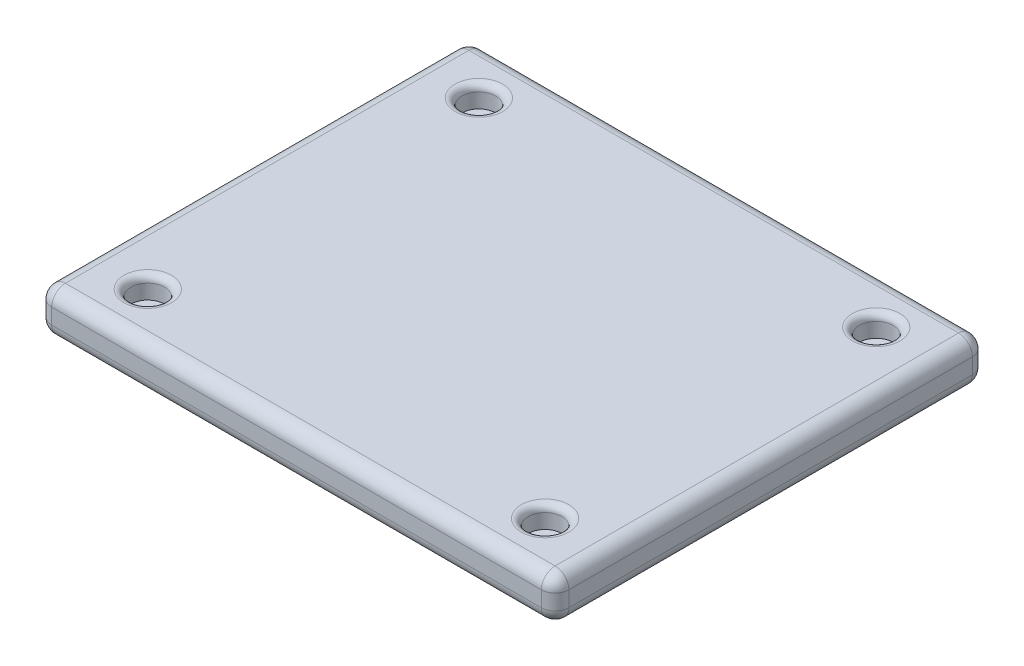
ISO-10303-21;
HEADER;
FILE_DESCRIPTION(('STEP AP214'),'2;1');
FILE_NAME('part.step','',(''),(''),'','','');
FILE_SCHEMA(('AUTOMOTIVE_DESIGN { 1 0 10303 214 1 1 1 1 }'));
ENDSEC;
DATA;
#1=APPLICATION_CONTEXT('core data for automotive mechanical design processes');
#2=APPLICATION_PROTOCOL_DEFINITION('international standard','automotive_design',2000,#1);
#3=PRODUCT_CONTEXT('',#1,'mechanical');
#4=PRODUCT('Part','Part','',(#3));
#5=PRODUCT_RELATED_PRODUCT_CATEGORY('part','',(#4));
#6=PRODUCT_DEFINITION_FORMATION('','',#4);
#7=PRODUCT_DEFINITION_CONTEXT('part definition',#1,'design');
#8=PRODUCT_DEFINITION('design','',#6,#7);
#9=PRODUCT_DEFINITION_SHAPE('','',#8);
#10=(LENGTH_UNIT() NAMED_UNIT(*) SI_UNIT(.MILLI.,.METRE.));
#11=(NAMED_UNIT(*) PLANE_ANGLE_UNIT() SI_UNIT($,.RADIAN.));
#12=(NAMED_UNIT(*) SI_UNIT($,.STERADIAN.) SOLID_ANGLE_UNIT());
#13=UNCERTAINTY_MEASURE_WITH_UNIT(LENGTH_MEASURE(1.E-05),#10,'distance_accuracy_value','');
#14=(GEOMETRIC_REPRESENTATION_CONTEXT(3) GLOBAL_UNCERTAINTY_ASSIGNED_CONTEXT((#13)) GLOBAL_UNIT_ASSIGNED_CONTEXT((#10,
#11,#12)) REPRESENTATION_CONTEXT('',''));
#15=CARTESIAN_POINT('',(0.,0.,0.));
#16=DIRECTION('',(0.,0.,1.));
#17=DIRECTION('',(1.,0.,0.));
#18=AXIS2_PLACEMENT_3D('',#15,#16,#17);
#19=CARTESIAN_POINT('',(-37.5000000000001,28.0362849678757,-31.25));
#20=DIRECTION('',(1.,0.,0.));
#21=DIRECTION('',(0.,0.,-1.));
#22=AXIS2_PLACEMENT_3D('',#19,#20,#21);
#23=PLANE('',#22);
#24=DIRECTION('',(0.,0.,1.));
#25=VECTOR('',#24,1.);
#26=CARTESIAN_POINT('',(-37.5000000000001,23.7862849678757,31.25));
#27=LINE('',#26,#25);
#28=CARTESIAN_POINT('',(-37.5000000000001,23.7862849678757,-29.25));
#29=VERTEX_POINT('',#28);
#30=CARTESIAN_POINT('',(-37.5000000000001,23.7862849678757,29.25));
#31=VERTEX_POINT('',#30);
#32=EDGE_CURVE('E173',#29,#31,#27,.T.);
#33=ORIENTED_EDGE('',*,*,#32,.T.);
#34=DIRECTION('',(0.,-1.,0.));
#35=VECTOR('',#34,1.);
#36=CARTESIAN_POINT('',(-37.5000000000001,28.0362849678757,29.25));
#37=LINE('',#36,#35);
#38=CARTESIAN_POINT('',(-37.5000000000001,26.0362849678757,29.25));
#39=VERTEX_POINT('',#38);
#40=EDGE_CURVE('E178',#31,#39,#37,.F.);
#41=ORIENTED_EDGE('',*,*,#40,.T.);
#42=DIRECTION('',(0.,0.,1.));
#43=VECTOR('',#42,1.);
#44=CARTESIAN_POINT('',(-37.5000000000001,26.0362849678757,-31.25));
#45=LINE('',#44,#43);
#46=CARTESIAN_POINT('',(-37.5000000000001,26.0362849678757,-29.25));
#47=VERTEX_POINT('',#46);
#48=EDGE_CURVE('E175',#39,#47,#45,.F.);
#49=ORIENTED_EDGE('',*,*,#48,.T.);
#50=DIRECTION('',(0.,-1.,0.));
#51=VECTOR('',#50,1.);
#52=CARTESIAN_POINT('',(-37.5000000000001,28.0362849678757,-29.25));
#53=LINE('',#52,#51);
#54=EDGE_CURVE('E171',#47,#29,#53,.T.);
#55=ORIENTED_EDGE('',*,*,#54,.T.);
#56=EDGE_LOOP('',(#33,#41,#49,#55));
#57=FACE_BOUND('',#56,.T.);
#58=ADVANCED_FACE('F37',(#57),#23,.F.);
#59=CARTESIAN_POINT('',(37.4999999999999,28.0362849678757,31.25));
#60=DIRECTION('',(0.,0.,-1.));
#61=DIRECTION('',(-1.,0.,0.));
#62=AXIS2_PLACEMENT_3D('',#59,#60,#61);
#63=PLANE('',#62);
#64=DIRECTION('',(1.,0.,0.));
#65=VECTOR('',#64,1.);
#66=CARTESIAN_POINT('',(37.4999999999999,26.0362849678757,31.25));
#67=LINE('',#66,#65);
#68=CARTESIAN_POINT('',(35.4999999999999,26.0362849678757,31.25));
#69=VERTEX_POINT('',#68);
#70=CARTESIAN_POINT('',(-35.5000000000001,26.0362849678757,31.25));
#71=VERTEX_POINT('',#70);
#72=EDGE_CURVE('E193',#69,#71,#67,.F.);
#73=ORIENTED_EDGE('',*,*,#72,.T.);
#74=DIRECTION('',(0.,-1.,0.));
#75=VECTOR('',#74,1.);
#76=CARTESIAN_POINT('',(-35.5000000000001,28.0362849678757,31.25));
#77=LINE('',#76,#75);
#78=CARTESIAN_POINT('',(-35.5000000000001,23.7862849678757,31.25));
#79=VERTEX_POINT('',#78);
#80=EDGE_CURVE('E195',#71,#79,#77,.T.);
#81=ORIENTED_EDGE('',*,*,#80,.T.);
#82=DIRECTION('',(1.,0.,0.));
#83=VECTOR('',#82,1.);
#84=CARTESIAN_POINT('',(37.4999999999999,23.7862849678757,31.25));
#85=LINE('',#84,#83);
#86=CARTESIAN_POINT('',(35.4999999999999,23.7862849678757,31.25));
#87=VERTEX_POINT('',#86);
#88=EDGE_CURVE('E191',#79,#87,#85,.T.);
#89=ORIENTED_EDGE('',*,*,#88,.T.);
#90=DIRECTION('',(0.,-1.,0.));
#91=VECTOR('',#90,1.);
#92=CARTESIAN_POINT('',(35.4999999999999,28.0362849678757,31.25));
#93=LINE('',#92,#91);
#94=EDGE_CURVE('E189',#87,#69,#93,.F.);
#95=ORIENTED_EDGE('',*,*,#94,.T.);
#96=EDGE_LOOP('',(#73,#81,#89,#95));
#97=FACE_BOUND('',#96,.T.);
#98=ADVANCED_FACE('F322',(#97),#63,.F.);
#99=CARTESIAN_POINT('',(37.4999999999999,28.0362849678757,-31.25));
#100=DIRECTION('',(-1.,0.,0.));
#101=DIRECTION('',(0.,0.,1.));
#102=AXIS2_PLACEMENT_3D('',#99,#100,#101);
#103=PLANE('',#102);
#104=DIRECTION('',(0.,0.,-1.));
#105=VECTOR('',#104,1.);
#106=CARTESIAN_POINT('',(37.4999999999999,26.0362849678757,-31.25));
#107=LINE('',#106,#105);
#108=CARTESIAN_POINT('',(37.4999999999999,26.0362849678757,-29.25));
#109=VERTEX_POINT('',#108);
#110=CARTESIAN_POINT('',(37.4999999999999,26.0362849678757,29.25));
#111=VERTEX_POINT('',#110);
#112=EDGE_CURVE('E143',#109,#111,#107,.F.);
#113=ORIENTED_EDGE('',*,*,#112,.T.);
#114=DIRECTION('',(0.,-1.,0.));
#115=VECTOR('',#114,1.);
#116=CARTESIAN_POINT('',(37.4999999999999,28.0362849678757,29.25));
#117=LINE('',#116,#115);
#118=CARTESIAN_POINT('',(37.4999999999999,23.7862849678757,29.25));
#119=VERTEX_POINT('',#118);
#120=EDGE_CURVE('E203',#111,#119,#117,.T.);
#121=ORIENTED_EDGE('',*,*,#120,.T.);
#122=DIRECTION('',(0.,0.,-1.));
#123=VECTOR('',#122,1.);
#124=CARTESIAN_POINT('',(37.4999999999999,23.7862849678757,-31.25));
#125=LINE('',#124,#123);
#126=CARTESIAN_POINT('',(37.4999999999999,23.7862849678757,-29.25));
#127=VERTEX_POINT('',#126);
#128=EDGE_CURVE('E200',#119,#127,#125,.T.);
#129=ORIENTED_EDGE('',*,*,#128,.T.);
#130=DIRECTION('',(0.,-1.,0.));
#131=VECTOR('',#130,1.);
#132=CARTESIAN_POINT('',(37.4999999999999,28.0362849678757,-29.25));
#133=LINE('',#132,#131);
#134=EDGE_CURVE('E198',#127,#109,#133,.F.);
#135=ORIENTED_EDGE('',*,*,#134,.T.);
#136=EDGE_LOOP('',(#113,#121,#129,#135));
#137=FACE_BOUND('',#136,.T.);
#138=ADVANCED_FACE('F328',(#137),#103,.F.);
#139=CARTESIAN_POINT('',(37.4999999999999,28.0362849678757,-31.25));
#140=DIRECTION('',(0.,0.,1.));
#141=DIRECTION('',(1.,0.,0.));
#142=AXIS2_PLACEMENT_3D('',#139,#140,#141);
#143=PLANE('',#142);
#144=DIRECTION('',(-1.,0.,0.));
#145=VECTOR('',#144,1.);
#146=CARTESIAN_POINT('',(37.4999999999999,26.0362849678757,-31.25));
#147=LINE('',#146,#145);
#148=CARTESIAN_POINT('',(-35.5000000000001,26.0362849678757,-31.25));
#149=VERTEX_POINT('',#148);
#150=CARTESIAN_POINT('',(35.4999999999999,26.0362849678757,-31.25));
#151=VERTEX_POINT('',#150);
#152=EDGE_CURVE('E46',#149,#151,#147,.F.);
#153=ORIENTED_EDGE('',*,*,#152,.T.);
#154=DIRECTION('',(0.,-1.,0.));
#155=VECTOR('',#154,1.);
#156=CARTESIAN_POINT('',(35.4999999999999,28.0362849678757,-31.25));
#157=LINE('',#156,#155);
#158=CARTESIAN_POINT('',(35.4999999999999,23.7862849678757,-31.25));
#159=VERTEX_POINT('',#158);
#160=EDGE_CURVE('E11',#151,#159,#157,.T.);
#161=ORIENTED_EDGE('',*,*,#160,.T.);
#162=DIRECTION('',(-1.,0.,0.));
#163=VECTOR('',#162,1.);
#164=CARTESIAN_POINT('',(-37.5000000000001,23.7862849678757,-31.25));
#165=LINE('',#164,#163);
#166=CARTESIAN_POINT('',(-35.5000000000001,23.7862849678757,-31.25));
#167=VERTEX_POINT('',#166);
#168=EDGE_CURVE('E206',#159,#167,#165,.T.);
#169=ORIENTED_EDGE('',*,*,#168,.T.);
#170=DIRECTION('',(0.,-1.,0.));
#171=VECTOR('',#170,1.);
#172=CARTESIAN_POINT('',(-35.5000000000001,28.0362849678757,-31.25));
#173=LINE('',#172,#171);
#174=EDGE_CURVE('E57',#167,#149,#173,.F.);
#175=ORIENTED_EDGE('',*,*,#174,.T.);
#176=EDGE_LOOP('',(#153,#161,#169,#175));
#177=FACE_BOUND('',#176,.T.);
#178=ADVANCED_FACE('F364',(#177),#143,.F.);
#179=CARTESIAN_POINT('',(0.,28.0362849678757,0.));
#180=DIRECTION('',(0.,-1.,0.));
#181=DIRECTION('',(0.,0.,-1.));
#182=AXIS2_PLACEMENT_3D('',#179,#180,#181);
#183=PLANE('',#182);
#184=DIRECTION('',(-1.,0.,0.));
#185=VECTOR('',#184,1.);
#186=CARTESIAN_POINT('',(-1.01765154403783E-13,28.0362849678757,-29.25));
#187=LINE('',#186,#185);
#188=CARTESIAN_POINT('',(35.4999999999999,28.0362849678757,-29.25));
#189=VERTEX_POINT('',#188);
#190=CARTESIAN_POINT('',(-35.5000000000001,28.0362849678757,-29.25));
#191=VERTEX_POINT('',#190);
#192=EDGE_CURVE('E130',#189,#191,#187,.T.);
#193=ORIENTED_EDGE('',*,*,#192,.T.);
#194=DIRECTION('',(0.,0.,1.));
#195=VECTOR('',#194,1.);
#196=CARTESIAN_POINT('',(-35.5000000000001,28.0362849678757,0.));
#197=LINE('',#196,#195);
#198=CARTESIAN_POINT('',(-35.5000000000001,28.0362849678757,29.25));
#199=VERTEX_POINT('',#198);
#200=EDGE_CURVE('E169',#191,#199,#197,.T.);
#201=ORIENTED_EDGE('',*,*,#200,.T.);
#202=DIRECTION('',(1.,0.,0.));
#203=VECTOR('',#202,1.);
#204=CARTESIAN_POINT('',(0.,28.0362849678757,29.25));
#205=LINE('',#204,#203);
#206=CARTESIAN_POINT('',(35.4999999999999,28.0362849678757,29.25));
#207=VERTEX_POINT('',#206);
#208=EDGE_CURVE('E133',#199,#207,#205,.T.);
#209=ORIENTED_EDGE('',*,*,#208,.T.);
#210=DIRECTION('',(0.,0.,-1.));
#211=VECTOR('',#210,1.);
#212=CARTESIAN_POINT('',(35.4999999999999,28.0362849678757,0.));
#213=LINE('',#212,#211);
#214=EDGE_CURVE('E124',#207,#189,#213,.T.);
#215=ORIENTED_EDGE('',*,*,#214,.T.);
#216=EDGE_LOOP('',(#193,#201,#209,#215));
#217=FACE_BOUND('',#216,.T.);
#218=CARTESIAN_POINT('',(-28.8082979849017,28.0362849678757,24.006914987418));
#219=DIRECTION('',(0.,-1.,0.));
#220=DIRECTION('',(0.,0.,-1.));
#221=AXIS2_PLACEMENT_3D('',#218,#219,#220);
#222=CIRCLE('',#221,3.45);
#223=CARTESIAN_POINT('',(-28.8082979849017,28.0362849678757,20.556914987418));
#224=VERTEX_POINT('',#223);
#225=EDGE_CURVE('E294',#224,#224,#222,.T.);
#226=ORIENTED_EDGE('',*,*,#225,.T.);
#227=EDGE_LOOP('',(#226));
#228=FACE_BOUND('',#227,.T.);
#229=CARTESIAN_POINT('',(28.8082979849017,28.0362849678757,24.0069149874178));
#230=DIRECTION('',(0.,-1.,0.));
#231=DIRECTION('',(0.,0.,-1.));
#232=AXIS2_PLACEMENT_3D('',#229,#230,#231);
#233=CIRCLE('',#232,3.45);
#234=CARTESIAN_POINT('',(28.8082979849017,28.0362849678757,20.5569149874178));
#235=VERTEX_POINT('',#234);
#236=EDGE_CURVE('E291',#235,#235,#233,.T.);
#237=ORIENTED_EDGE('',*,*,#236,.T.);
#238=EDGE_LOOP('',(#237));
#239=FACE_BOUND('',#238,.T.);
#240=CARTESIAN_POINT('',(28.8082979849017,28.0362849678757,-24.0069149874178));
#241=DIRECTION('',(0.,-1.,0.));
#242=DIRECTION('',(0.,0.,-1.));
#243=AXIS2_PLACEMENT_3D('',#240,#241,#242);
#244=CIRCLE('',#243,3.45);
#245=CARTESIAN_POINT('',(28.8082979849017,28.0362849678757,-27.4569149874178));
#246=VERTEX_POINT('',#245);
#247=EDGE_CURVE('E288',#246,#246,#244,.T.);
#248=ORIENTED_EDGE('',*,*,#247,.T.);
#249=EDGE_LOOP('',(#248));
#250=FACE_BOUND('',#249,.T.);
#251=CARTESIAN_POINT('',(-28.8082979849017,28.0362849678757,-24.006914987418));
#252=DIRECTION('',(0.,-1.,0.));
#253=DIRECTION('',(0.,0.,-1.));
#254=AXIS2_PLACEMENT_3D('',#251,#252,#253);
#255=CIRCLE('',#254,3.45);
#256=CARTESIAN_POINT('',(-28.8082979849017,28.0362849678757,-27.456914987418));
#257=VERTEX_POINT('',#256);
#258=EDGE_CURVE('E285',#257,#257,#255,.T.);
#259=ORIENTED_EDGE('',*,*,#258,.T.);
#260=EDGE_LOOP('',(#259));
#261=FACE_BOUND('',#260,.T.);
#262=ADVANCED_FACE('F126',(#217,#228,#239,#250,#261),#183,.F.);
#263=CARTESIAN_POINT('',(0.,21.7862849678757,0.));
#264=DIRECTION('',(0.,-1.,0.));
#265=DIRECTION('',(0.,0.,-1.));
#266=AXIS2_PLACEMENT_3D('',#263,#264,#265);
#267=PLANE('',#266);
#268=DIRECTION('',(1.,0.,0.));
#269=VECTOR('',#268,1.);
#270=CARTESIAN_POINT('',(-37.5000000000001,21.7862849678757,29.25));
#271=LINE('',#270,#269);
#272=CARTESIAN_POINT('',(35.4999999999999,21.7862849678757,29.25));
#273=VERTEX_POINT('',#272);
#274=CARTESIAN_POINT('',(-35.5000000000001,21.7862849678757,29.25));
#275=VERTEX_POINT('',#274);
#276=EDGE_CURVE('E184',#273,#275,#271,.F.);
#277=ORIENTED_EDGE('',*,*,#276,.T.);
#278=DIRECTION('',(0.,0.,1.));
#279=VECTOR('',#278,1.);
#280=CARTESIAN_POINT('',(-35.5000000000001,21.7862849678757,-31.25));
#281=LINE('',#280,#279);
#282=CARTESIAN_POINT('',(-35.5000000000001,21.7862849678757,-29.25));
#283=VERTEX_POINT('',#282);
#284=EDGE_CURVE('E186',#275,#283,#281,.F.);
#285=ORIENTED_EDGE('',*,*,#284,.T.);
#286=DIRECTION('',(-1.,0.,0.));
#287=VECTOR('',#286,1.);
#288=CARTESIAN_POINT('',(37.4999999999999,21.7862849678757,-29.25));
#289=LINE('',#288,#287);
#290=CARTESIAN_POINT('',(35.4999999999999,21.7862849678757,-29.25));
#291=VERTEX_POINT('',#290);
#292=EDGE_CURVE('E180',#283,#291,#289,.F.);
#293=ORIENTED_EDGE('',*,*,#292,.T.);
#294=DIRECTION('',(0.,0.,-1.));
#295=VECTOR('',#294,1.);
#296=CARTESIAN_POINT('',(35.4999999999999,21.7862849678757,31.25));
#297=LINE('',#296,#295);
#298=EDGE_CURVE('E182',#291,#273,#297,.F.);
#299=ORIENTED_EDGE('',*,*,#298,.T.);
#300=EDGE_LOOP('',(#277,#285,#293,#299));
#301=FACE_BOUND('',#300,.T.);
#302=ADVANCED_FACE('F349',(#301),#267,.T.);
#303=CARTESIAN_POINT('',(-28.8082979849017,24.9112849678757,24.006914987418));
#304=DIRECTION('',(0.,1.,0.));
#305=DIRECTION('',(0.,0.,1.));
#306=AXIS2_PLACEMENT_3D('',#303,#304,#305);
#307=CYLINDRICAL_SURFACE('',#306,2.45);
#308=CARTESIAN_POINT('',(-28.8082979849017,27.0362849678757,24.006914987418));
#309=DIRECTION('',(0.,-1.,0.));
#310=DIRECTION('',(0.,0.,-1.));
#311=AXIS2_PLACEMENT_3D('',#308,#309,#310);
#312=CIRCLE('',#311,2.45);
#313=CARTESIAN_POINT('',(-28.8082979849017,27.0362849678757,21.556914987418));
#314=VERTEX_POINT('',#313);
#315=EDGE_CURVE('E282',#314,#314,#312,.F.);
#316=ORIENTED_EDGE('',*,*,#315,.T.);
#317=EDGE_LOOP('',(#316));
#318=FACE_BOUND('',#317,.T.);
#319=CARTESIAN_POINT('',(-28.8082979849017,24.9112849678757,24.006914987418));
#320=DIRECTION('',(0.,1.,0.));
#321=DIRECTION('',(0.,0.,1.));
#322=AXIS2_PLACEMENT_3D('',#319,#320,#321);
#323=CIRCLE('',#322,2.45);
#324=CARTESIAN_POINT('',(-28.8082979849017,24.9112849678757,26.456914987418));
#325=VERTEX_POINT('',#324);
#326=EDGE_CURVE('E279',#325,#325,#323,.T.);
#327=ORIENTED_EDGE('',*,*,#326,.F.);
#328=EDGE_LOOP('',(#327));
#329=FACE_BOUND('',#328,.T.);
#330=ADVANCED_FACE('F345',(#318,#329),#307,.F.);
#331=CARTESIAN_POINT('',(-28.8082979849017,24.9112849678757,24.006914987418));
#332=DIRECTION('',(0.,1.,0.));
#333=DIRECTION('',(0.,0.,1.));
#334=AXIS2_PLACEMENT_3D('',#331,#332,#333);
#335=PLANE('',#334);
#336=ORIENTED_EDGE('',*,*,#326,.T.);
#337=EDGE_LOOP('',(#336));
#338=FACE_BOUND('',#337,.T.);
#339=ADVANCED_FACE('F348',(#338),#335,.T.);
#340=CARTESIAN_POINT('',(28.8082979849017,24.9112849678757,-24.0069149874178));
#341=DIRECTION('',(0.,1.,0.));
#342=DIRECTION('',(0.,0.,1.));
#343=AXIS2_PLACEMENT_3D('',#340,#341,#342);
#344=CYLINDRICAL_SURFACE('',#343,2.45);
#345=CARTESIAN_POINT('',(28.8082979849017,27.0362849678757,-24.0069149874178));
#346=DIRECTION('',(0.,-1.,0.));
#347=DIRECTION('',(0.,0.,-1.));
#348=AXIS2_PLACEMENT_3D('',#345,#346,#347);
#349=CIRCLE('',#348,2.45);
#350=CARTESIAN_POINT('',(28.8082979849017,27.0362849678757,-26.4569149874178));
#351=VERTEX_POINT('',#350);
#352=EDGE_CURVE('E164',#351,#351,#349,.F.);
#353=ORIENTED_EDGE('',*,*,#352,.T.);
#354=EDGE_LOOP('',(#353));
#355=FACE_BOUND('',#354,.T.);
#356=CARTESIAN_POINT('',(28.8082979849017,24.9112849678757,-24.0069149874178));
#357=DIRECTION('',(0.,1.,0.));
#358=DIRECTION('',(0.,0.,1.));
#359=AXIS2_PLACEMENT_3D('',#356,#357,#358);
#360=CIRCLE('',#359,2.45);
#361=CARTESIAN_POINT('',(28.8082979849017,24.9112849678757,-21.5569149874178));
#362=VERTEX_POINT('',#361);
#363=EDGE_CURVE('E275',#362,#362,#360,.T.);
#364=ORIENTED_EDGE('',*,*,#363,.F.);
#365=EDGE_LOOP('',(#364));
#366=FACE_BOUND('',#365,.T.);
#367=ADVANCED_FACE('F302',(#355,#366),#344,.F.);
#368=CARTESIAN_POINT('',(28.8082979849017,24.9112849678757,-24.0069149874178));
#369=DIRECTION('',(0.,1.,0.));
#370=DIRECTION('',(0.,0.,1.));
#371=AXIS2_PLACEMENT_3D('',#368,#369,#370);
#372=PLANE('',#371);
#373=ORIENTED_EDGE('',*,*,#363,.T.);
#374=EDGE_LOOP('',(#373));
#375=FACE_BOUND('',#374,.T.);
#376=ADVANCED_FACE('F358',(#375),#372,.T.);
#377=CARTESIAN_POINT('',(28.8082979849017,24.9112849678757,24.0069149874178));
#378=DIRECTION('',(0.,1.,0.));
#379=DIRECTION('',(0.,0.,1.));
#380=AXIS2_PLACEMENT_3D('',#377,#378,#379);
#381=CYLINDRICAL_SURFACE('',#380,2.45);
#382=CARTESIAN_POINT('',(28.8082979849017,27.0362849678757,24.0069149874178));
#383=DIRECTION('',(0.,-1.,0.));
#384=DIRECTION('',(0.,0.,-1.));
#385=AXIS2_PLACEMENT_3D('',#382,#383,#384);
#386=CIRCLE('',#385,2.45);
#387=CARTESIAN_POINT('',(28.8082979849017,27.0362849678757,21.5569149874178));
#388=VERTEX_POINT('',#387);
#389=EDGE_CURVE('E297',#388,#388,#386,.F.);
#390=ORIENTED_EDGE('',*,*,#389,.T.);
#391=EDGE_LOOP('',(#390));
#392=FACE_BOUND('',#391,.T.);
#393=CARTESIAN_POINT('',(28.8082979849017,24.9112849678757,24.0069149874178));
#394=DIRECTION('',(0.,1.,0.));
#395=DIRECTION('',(0.,0.,-1.));
#396=AXIS2_PLACEMENT_3D('',#393,#394,#395);
#397=CIRCLE('',#396,2.45);
#398=CARTESIAN_POINT('',(28.8082979849017,24.9112849678757,21.5569149874178));
#399=VERTEX_POINT('',#398);
#400=EDGE_CURVE('E270',#399,#399,#397,.T.);
#401=ORIENTED_EDGE('',*,*,#400,.F.);
#402=EDGE_LOOP('',(#401));
#403=FACE_BOUND('',#402,.T.);
#404=ADVANCED_FACE('F630',(#392,#403),#381,.F.);
#405=CARTESIAN_POINT('',(28.8082979849017,24.9112849678757,24.0069149874178));
#406=DIRECTION('',(0.,-1.,0.));
#407=DIRECTION('',(0.,0.,-1.));
#408=AXIS2_PLACEMENT_3D('',#405,#406,#407);
#409=PLANE('',#408);
#410=ORIENTED_EDGE('',*,*,#400,.T.);
#411=EDGE_LOOP('',(#410));
#412=FACE_BOUND('',#411,.T.);
#413=ADVANCED_FACE('F622',(#412),#409,.F.);
#414=CARTESIAN_POINT('',(-28.8082979849017,24.9112849678757,-24.006914987418));
#415=DIRECTION('',(0.,1.,0.));
#416=DIRECTION('',(0.,0.,1.));
#417=AXIS2_PLACEMENT_3D('',#414,#415,#416);
#418=CYLINDRICAL_SURFACE('',#417,2.45);
#419=CARTESIAN_POINT('',(-28.8082979849017,27.0362849678757,-24.006914987418));
#420=DIRECTION('',(0.,-1.,0.));
#421=DIRECTION('',(0.,0.,-1.));
#422=AXIS2_PLACEMENT_3D('',#419,#420,#421);
#423=CIRCLE('',#422,2.45);
#424=CARTESIAN_POINT('',(-28.8082979849017,27.0362849678757,-26.456914987418));
#425=VERTEX_POINT('',#424);
#426=EDGE_CURVE('E161',#425,#425,#423,.F.);
#427=ORIENTED_EDGE('',*,*,#426,.T.);
#428=EDGE_LOOP('',(#427));
#429=FACE_BOUND('',#428,.T.);
#430=CARTESIAN_POINT('',(-28.8082979849017,24.9112849678757,-24.006914987418));
#431=DIRECTION('',(0.,1.,0.));
#432=DIRECTION('',(0.,0.,-1.));
#433=AXIS2_PLACEMENT_3D('',#430,#431,#432);
#434=CIRCLE('',#433,2.45);
#435=CARTESIAN_POINT('',(-28.8082979849017,24.9112849678757,-26.456914987418));
#436=VERTEX_POINT('',#435);
#437=EDGE_CURVE('E264',#436,#436,#434,.T.);
#438=ORIENTED_EDGE('',*,*,#437,.F.);
#439=EDGE_LOOP('',(#438));
#440=FACE_BOUND('',#439,.T.);
#441=ADVANCED_FACE('F339',(#429,#440),#418,.F.);
#442=CARTESIAN_POINT('',(-28.8082979849017,24.9112849678757,-24.006914987418));
#443=DIRECTION('',(0.,-1.,0.));
#444=DIRECTION('',(0.,0.,-1.));
#445=AXIS2_PLACEMENT_3D('',#442,#443,#444);
#446=PLANE('',#445);
#447=ORIENTED_EDGE('',*,*,#437,.T.);
#448=EDGE_LOOP('',(#447));
#449=FACE_BOUND('',#448,.T.);
#450=ADVANCED_FACE('F334',(#449),#446,.F.);
#451=CARTESIAN_POINT('',(-28.8082979849017,27.0362849678757,24.006914987418));
#452=DIRECTION('',(0.,-1.,0.));
#453=DIRECTION('',(0.,0.,-1.));
#454=AXIS2_PLACEMENT_3D('',#451,#452,#453);
#455=TOROIDAL_SURFACE('',#454,3.45,1.);
#456=ORIENTED_EDGE('',*,*,#225,.F.);
#457=EDGE_LOOP('',(#456));
#458=FACE_BOUND('',#457,.T.);
#459=ORIENTED_EDGE('',*,*,#315,.F.);
#460=EDGE_LOOP('',(#459));
#461=FACE_BOUND('',#460,.T.);
#462=ADVANCED_FACE('F317',(#458,#461),#455,.T.);
#463=CARTESIAN_POINT('',(28.8082979849017,27.0362849678757,24.0069149874178));
#464=DIRECTION('',(0.,-1.,0.));
#465=DIRECTION('',(0.,0.,-1.));
#466=AXIS2_PLACEMENT_3D('',#463,#464,#465);
#467=TOROIDAL_SURFACE('',#466,3.45,1.);
#468=ORIENTED_EDGE('',*,*,#236,.F.);
#469=EDGE_LOOP('',(#468));
#470=FACE_BOUND('',#469,.T.);
#471=ORIENTED_EDGE('',*,*,#389,.F.);
#472=EDGE_LOOP('',(#471));
#473=FACE_BOUND('',#472,.T.);
#474=ADVANCED_FACE('F308',(#470,#473),#467,.T.);
#475=CARTESIAN_POINT('',(28.8082979849017,27.0362849678757,-24.0069149874178));
#476=DIRECTION('',(0.,-1.,0.));
#477=DIRECTION('',(0.,0.,-1.));
#478=AXIS2_PLACEMENT_3D('',#475,#476,#477);
#479=TOROIDAL_SURFACE('',#478,3.45,1.);
#480=ORIENTED_EDGE('',*,*,#247,.F.);
#481=EDGE_LOOP('',(#480));
#482=FACE_BOUND('',#481,.T.);
#483=ORIENTED_EDGE('',*,*,#352,.F.);
#484=EDGE_LOOP('',(#483));
#485=FACE_BOUND('',#484,.T.);
#486=ADVANCED_FACE('F305',(#482,#485),#479,.T.);
#487=CARTESIAN_POINT('',(-28.8082979849017,27.0362849678757,-24.006914987418));
#488=DIRECTION('',(0.,-1.,0.));
#489=DIRECTION('',(0.,0.,-1.));
#490=AXIS2_PLACEMENT_3D('',#487,#488,#489);
#491=TOROIDAL_SURFACE('',#490,3.45,1.);
#492=ORIENTED_EDGE('',*,*,#258,.F.);
#493=EDGE_LOOP('',(#492));
#494=FACE_BOUND('',#493,.T.);
#495=ORIENTED_EDGE('',*,*,#426,.F.);
#496=EDGE_LOOP('',(#495));
#497=FACE_BOUND('',#496,.T.);
#498=ADVANCED_FACE('F307',(#494,#497),#491,.T.);
#499=CARTESIAN_POINT('',(35.4999999999999,23.7862849678757,-31.25));
#500=DIRECTION('',(0.,0.,1.));
#501=DIRECTION('',(1.,0.,0.));
#502=AXIS2_PLACEMENT_3D('',#499,#500,#501);
#503=CYLINDRICAL_SURFACE('',#502,2.);
#504=CARTESIAN_POINT('',(35.4999999999999,23.7862849678757,-29.25));
#505=DIRECTION('',(0.,0.,-1.));
#506=DIRECTION('',(-1.,0.,0.));
#507=AXIS2_PLACEMENT_3D('',#504,#505,#506);
#508=CIRCLE('',#507,2.);
#509=EDGE_CURVE('E41',#127,#291,#508,.T.);
#510=ORIENTED_EDGE('',*,*,#509,.F.);
#511=ORIENTED_EDGE('',*,*,#128,.F.);
#512=CARTESIAN_POINT('',(35.4999999999999,23.7862849678757,29.25));
#513=DIRECTION('',(0.,0.,1.));
#514=DIRECTION('',(1.,0.,0.));
#515=AXIS2_PLACEMENT_3D('',#512,#513,#514);
#516=CIRCLE('',#515,2.);
#517=EDGE_CURVE('E256',#273,#119,#516,.T.);
#518=ORIENTED_EDGE('',*,*,#517,.F.);
#519=ORIENTED_EDGE('',*,*,#298,.F.);
#520=EDGE_LOOP('',(#510,#511,#518,#519));
#521=FACE_BOUND('',#520,.T.);
#522=ADVANCED_FACE('F39',(#521),#503,.T.);
#523=CARTESIAN_POINT('',(35.4999999999999,23.7862849678757,-29.25));
#524=DIRECTION('',(0.,-1.,0.));
#525=DIRECTION('',(0.,0.,-1.));
#526=AXIS2_PLACEMENT_3D('',#523,#524,#525);
#527=SPHERICAL_SURFACE('',#526,2.);
#528=CARTESIAN_POINT('',(35.4999999999999,23.7862849678757,-29.25));
#529=DIRECTION('',(0.,-1.,0.));
#530=DIRECTION('',(0.,0.,-1.));
#531=AXIS2_PLACEMENT_3D('',#528,#529,#530);
#532=CIRCLE('',#531,2.);
#533=EDGE_CURVE('E251',#127,#159,#532,.F.);
#534=ORIENTED_EDGE('',*,*,#533,.F.);
#535=ORIENTED_EDGE('',*,*,#509,.T.);
#536=CARTESIAN_POINT('',(35.4999999999999,23.7862849678757,-29.25));
#537=DIRECTION('',(1.,0.,0.));
#538=DIRECTION('',(0.,0.,-1.));
#539=AXIS2_PLACEMENT_3D('',#536,#537,#538);
#540=CIRCLE('',#539,2.);
#541=EDGE_CURVE('E254',#159,#291,#540,.F.);
#542=ORIENTED_EDGE('',*,*,#541,.F.);
#543=EDGE_LOOP('',(#534,#535,#542));
#544=FACE_BOUND('',#543,.T.);
#545=ADVANCED_FACE('F404',(#544),#527,.T.);
#546=CARTESIAN_POINT('',(35.4999999999999,23.7862849678757,29.25));
#547=DIRECTION('',(1.,0.,0.));
#548=DIRECTION('',(0.,0.,-1.));
#549=AXIS2_PLACEMENT_3D('',#546,#547,#548);
#550=SPHERICAL_SURFACE('',#549,2.);
#551=CARTESIAN_POINT('',(35.4999999999999,23.7862849678757,29.25));
#552=DIRECTION('',(1.,0.,0.));
#553=DIRECTION('',(0.,0.,-1.));
#554=AXIS2_PLACEMENT_3D('',#551,#552,#553);
#555=CIRCLE('',#554,2.);
#556=EDGE_CURVE('E246',#273,#87,#555,.F.);
#557=ORIENTED_EDGE('',*,*,#556,.F.);
#558=ORIENTED_EDGE('',*,*,#517,.T.);
#559=CARTESIAN_POINT('',(35.4999999999999,23.7862849678757,29.25));
#560=DIRECTION('',(0.,-1.,0.));
#561=DIRECTION('',(0.,0.,-1.));
#562=AXIS2_PLACEMENT_3D('',#559,#560,#561);
#563=CIRCLE('',#562,2.);
#564=EDGE_CURVE('E249',#87,#119,#563,.F.);
#565=ORIENTED_EDGE('',*,*,#564,.F.);
#566=EDGE_LOOP('',(#557,#558,#565));
#567=FACE_BOUND('',#566,.T.);
#568=ADVANCED_FACE('F401',(#567),#550,.T.);
#569=CARTESIAN_POINT('',(37.4999999999999,23.7862849678757,-29.25));
#570=DIRECTION('',(1.,0.,0.));
#571=DIRECTION('',(0.,0.,-1.));
#572=AXIS2_PLACEMENT_3D('',#569,#570,#571);
#573=CYLINDRICAL_SURFACE('',#572,2.);
#574=ORIENTED_EDGE('',*,*,#541,.T.);
#575=ORIENTED_EDGE('',*,*,#292,.F.);
#576=CARTESIAN_POINT('',(-35.5000000000001,23.7862849678757,-29.25));
#577=DIRECTION('',(-1.,0.,0.));
#578=DIRECTION('',(0.,0.,1.));
#579=AXIS2_PLACEMENT_3D('',#576,#577,#578);
#580=CIRCLE('',#579,2.);
#581=EDGE_CURVE('E241',#167,#283,#580,.T.);
#582=ORIENTED_EDGE('',*,*,#581,.F.);
#583=ORIENTED_EDGE('',*,*,#168,.F.);
#584=EDGE_LOOP('',(#574,#575,#582,#583));
#585=FACE_BOUND('',#584,.T.);
#586=ADVANCED_FACE('F403',(#585),#573,.T.);
#587=CARTESIAN_POINT('',(35.4999999999999,28.0362849678757,-29.25));
#588=DIRECTION('',(0.,-1.,0.));
#589=DIRECTION('',(0.,0.,-1.));
#590=AXIS2_PLACEMENT_3D('',#587,#588,#589);
#591=CYLINDRICAL_SURFACE('',#590,2.);
#592=ORIENTED_EDGE('',*,*,#533,.T.);
#593=ORIENTED_EDGE('',*,*,#160,.F.);
#594=CARTESIAN_POINT('',(35.4999999999999,26.0362849678757,-29.25));
#595=DIRECTION('',(0.,1.,0.));
#596=DIRECTION('',(0.,0.,1.));
#597=AXIS2_PLACEMENT_3D('',#594,#595,#596);
#598=CIRCLE('',#597,2.);
#599=EDGE_CURVE('E147',#109,#151,#598,.T.);
#600=ORIENTED_EDGE('',*,*,#599,.F.);
#601=ORIENTED_EDGE('',*,*,#134,.F.);
#602=EDGE_LOOP('',(#592,#593,#600,#601));
#603=FACE_BOUND('',#602,.T.);
#604=ADVANCED_FACE('F410',(#603),#591,.T.);
#605=CARTESIAN_POINT('',(35.4999999999999,26.0362849678757,0.));
#606=DIRECTION('',(0.,0.,-1.));
#607=DIRECTION('',(-1.,0.,0.));
#608=AXIS2_PLACEMENT_3D('',#605,#606,#607);
#609=CYLINDRICAL_SURFACE('',#608,2.);
#610=CARTESIAN_POINT('',(35.4999999999999,26.0362849678757,29.25));
#611=DIRECTION('',(0.,0.,1.));
#612=DIRECTION('',(1.,0.,0.));
#613=AXIS2_PLACEMENT_3D('',#610,#611,#612);
#614=CIRCLE('',#613,2.);
#615=EDGE_CURVE('E148',#111,#207,#614,.T.);
#616=ORIENTED_EDGE('',*,*,#615,.F.);
#617=ORIENTED_EDGE('',*,*,#112,.F.);
#618=CARTESIAN_POINT('',(35.4999999999999,26.0362849678757,-29.25));
#619=DIRECTION('',(0.,0.,-1.));
#620=DIRECTION('',(-1.,0.,0.));
#621=AXIS2_PLACEMENT_3D('',#618,#619,#620);
#622=CIRCLE('',#621,2.);
#623=EDGE_CURVE('E140',#189,#109,#622,.T.);
#624=ORIENTED_EDGE('',*,*,#623,.F.);
#625=ORIENTED_EDGE('',*,*,#214,.F.);
#626=EDGE_LOOP('',(#616,#617,#624,#625));
#627=FACE_BOUND('',#626,.T.);
#628=ADVANCED_FACE('F142',(#627),#609,.T.);
#629=CARTESIAN_POINT('',(35.4999999999999,28.0362849678757,29.25));
#630=DIRECTION('',(0.,-1.,0.));
#631=DIRECTION('',(0.,0.,-1.));
#632=AXIS2_PLACEMENT_3D('',#629,#630,#631);
#633=CYLINDRICAL_SURFACE('',#632,2.);
#634=ORIENTED_EDGE('',*,*,#564,.T.);
#635=ORIENTED_EDGE('',*,*,#120,.F.);
#636=CARTESIAN_POINT('',(35.4999999999999,26.0362849678757,29.25));
#637=DIRECTION('',(0.,1.,0.));
#638=DIRECTION('',(0.,0.,1.));
#639=AXIS2_PLACEMENT_3D('',#636,#637,#638);
#640=CIRCLE('',#639,2.);
#641=EDGE_CURVE('E236',#69,#111,#640,.T.);
#642=ORIENTED_EDGE('',*,*,#641,.F.);
#643=ORIENTED_EDGE('',*,*,#94,.F.);
#644=EDGE_LOOP('',(#634,#635,#642,#643));
#645=FACE_BOUND('',#644,.T.);
#646=ADVANCED_FACE('F377',(#645),#633,.T.);
#647=CARTESIAN_POINT('',(37.4999999999999,23.7862849678757,29.25));
#648=DIRECTION('',(-1.,0.,0.));
#649=DIRECTION('',(0.,0.,1.));
#650=AXIS2_PLACEMENT_3D('',#647,#648,#649);
#651=CYLINDRICAL_SURFACE('',#650,2.);
#652=ORIENTED_EDGE('',*,*,#556,.T.);
#653=ORIENTED_EDGE('',*,*,#88,.F.);
#654=CARTESIAN_POINT('',(-35.5000000000001,23.7862849678757,29.25));
#655=DIRECTION('',(-1.,0.,0.));
#656=DIRECTION('',(0.,0.,1.));
#657=AXIS2_PLACEMENT_3D('',#654,#655,#656);
#658=CIRCLE('',#657,2.);
#659=EDGE_CURVE('E233',#275,#79,#658,.T.);
#660=ORIENTED_EDGE('',*,*,#659,.F.);
#661=ORIENTED_EDGE('',*,*,#276,.F.);
#662=EDGE_LOOP('',(#652,#653,#660,#661));
#663=FACE_BOUND('',#662,.T.);
#664=ADVANCED_FACE('F400',(#663),#651,.T.);
#665=CARTESIAN_POINT('',(-35.5000000000001,23.7862849678757,-31.25));
#666=DIRECTION('',(0.,0.,-1.));
#667=DIRECTION('',(-1.,0.,0.));
#668=AXIS2_PLACEMENT_3D('',#665,#666,#667);
#669=CYLINDRICAL_SURFACE('',#668,2.);
#670=CARTESIAN_POINT('',(-35.5000000000001,23.7862849678757,-29.25));
#671=DIRECTION('',(0.,0.,-1.));
#672=DIRECTION('',(-1.,0.,0.));
#673=AXIS2_PLACEMENT_3D('',#670,#671,#672);
#674=CIRCLE('',#673,2.);
#675=EDGE_CURVE('E243',#283,#29,#674,.T.);
#676=ORIENTED_EDGE('',*,*,#675,.F.);
#677=ORIENTED_EDGE('',*,*,#284,.F.);
#678=CARTESIAN_POINT('',(-35.5000000000001,23.7862849678757,29.25));
#679=DIRECTION('',(0.,0.,1.));
#680=DIRECTION('',(1.,0.,0.));
#681=AXIS2_PLACEMENT_3D('',#678,#679,#680);
#682=CIRCLE('',#681,2.);
#683=EDGE_CURVE('E230',#31,#275,#682,.T.);
#684=ORIENTED_EDGE('',*,*,#683,.F.);
#685=ORIENTED_EDGE('',*,*,#32,.F.);
#686=EDGE_LOOP('',(#676,#677,#684,#685));
#687=FACE_BOUND('',#686,.T.);
#688=ADVANCED_FACE('F423',(#687),#669,.T.);
#689=CARTESIAN_POINT('',(-35.5000000000001,23.7862849678757,-29.25));
#690=DIRECTION('',(0.,-1.,0.));
#691=DIRECTION('',(0.,0.,-1.));
#692=AXIS2_PLACEMENT_3D('',#689,#690,#691);
#693=SPHERICAL_SURFACE('',#692,2.);
#694=ORIENTED_EDGE('',*,*,#581,.T.);
#695=ORIENTED_EDGE('',*,*,#675,.T.);
#696=CARTESIAN_POINT('',(-35.5000000000001,23.7862849678757,-29.25));
#697=DIRECTION('',(0.,-1.,0.));
#698=DIRECTION('',(0.,0.,-1.));
#699=AXIS2_PLACEMENT_3D('',#696,#697,#698);
#700=CIRCLE('',#699,2.);
#701=EDGE_CURVE('E154',#167,#29,#700,.F.);
#702=ORIENTED_EDGE('',*,*,#701,.F.);
#703=EDGE_LOOP('',(#694,#695,#702));
#704=FACE_BOUND('',#703,.T.);
#705=ADVANCED_FACE('F426',(#704),#693,.T.);
#706=CARTESIAN_POINT('',(35.4999999999999,26.0362849678757,-29.25));
#707=DIRECTION('',(1.,0.,0.));
#708=DIRECTION('',(0.,0.,-1.));
#709=AXIS2_PLACEMENT_3D('',#706,#707,#708);
#710=SPHERICAL_SURFACE('',#709,2.);
#711=ORIENTED_EDGE('',*,*,#623,.T.);
#712=ORIENTED_EDGE('',*,*,#599,.T.);
#713=CARTESIAN_POINT('',(35.4999999999999,26.0362849678757,-29.25));
#714=DIRECTION('',(1.,0.,0.));
#715=DIRECTION('',(0.,1.,0.));
#716=AXIS2_PLACEMENT_3D('',#713,#714,#715);
#717=CIRCLE('',#716,2.);
#718=EDGE_CURVE('E151',#189,#151,#717,.F.);
#719=ORIENTED_EDGE('',*,*,#718,.F.);
#720=EDGE_LOOP('',(#711,#712,#719));
#721=FACE_BOUND('',#720,.T.);
#722=ADVANCED_FACE('F152',(#721),#710,.T.);
#723=CARTESIAN_POINT('',(35.4999999999999,26.0362849678757,29.25));
#724=DIRECTION('',(1.,0.,0.));
#725=DIRECTION('',(0.,0.,-1.));
#726=AXIS2_PLACEMENT_3D('',#723,#724,#725);
#727=SPHERICAL_SURFACE('',#726,2.);
#728=ORIENTED_EDGE('',*,*,#641,.T.);
#729=ORIENTED_EDGE('',*,*,#615,.T.);
#730=CARTESIAN_POINT('',(35.4999999999999,26.0362849678757,29.25));
#731=DIRECTION('',(1.,0.,0.));
#732=DIRECTION('',(0.,0.,-1.));
#733=AXIS2_PLACEMENT_3D('',#730,#731,#732);
#734=CIRCLE('',#733,2.);
#735=EDGE_CURVE('E155',#69,#207,#734,.F.);
#736=ORIENTED_EDGE('',*,*,#735,.F.);
#737=EDGE_LOOP('',(#728,#729,#736));
#738=FACE_BOUND('',#737,.T.);
#739=ADVANCED_FACE('F381',(#738),#727,.T.);
#740=CARTESIAN_POINT('',(-35.5000000000001,23.7862849678757,29.25));
#741=DIRECTION('',(0.,-1.,0.));
#742=DIRECTION('',(0.,0.,-1.));
#743=AXIS2_PLACEMENT_3D('',#740,#741,#742);
#744=SPHERICAL_SURFACE('',#743,2.);
#745=ORIENTED_EDGE('',*,*,#683,.T.);
#746=ORIENTED_EDGE('',*,*,#659,.T.);
#747=CARTESIAN_POINT('',(-35.5000000000001,23.7862849678757,29.25));
#748=DIRECTION('',(0.,-1.,0.));
#749=DIRECTION('',(0.,0.,-1.));
#750=AXIS2_PLACEMENT_3D('',#747,#748,#749);
#751=CIRCLE('',#750,2.);
#752=EDGE_CURVE('E224',#31,#79,#751,.F.);
#753=ORIENTED_EDGE('',*,*,#752,.F.);
#754=EDGE_LOOP('',(#745,#746,#753));
#755=FACE_BOUND('',#754,.T.);
#756=ADVANCED_FACE('F396',(#755),#744,.T.);
#757=CARTESIAN_POINT('',(-35.5000000000001,28.0362849678757,-29.25));
#758=DIRECTION('',(0.,-1.,0.));
#759=DIRECTION('',(0.,0.,-1.));
#760=AXIS2_PLACEMENT_3D('',#757,#758,#759);
#761=CYLINDRICAL_SURFACE('',#760,2.);
#762=ORIENTED_EDGE('',*,*,#701,.T.);
#763=ORIENTED_EDGE('',*,*,#54,.F.);
#764=CARTESIAN_POINT('',(-35.5000000000001,26.0362849678757,-29.25));
#765=DIRECTION('',(0.,1.,0.));
#766=DIRECTION('',(0.,0.,1.));
#767=AXIS2_PLACEMENT_3D('',#764,#765,#766);
#768=CIRCLE('',#767,2.);
#769=EDGE_CURVE('E221',#149,#47,#768,.T.);
#770=ORIENTED_EDGE('',*,*,#769,.F.);
#771=ORIENTED_EDGE('',*,*,#174,.F.);
#772=EDGE_LOOP('',(#762,#763,#770,#771));
#773=FACE_BOUND('',#772,.T.);
#774=ADVANCED_FACE('F437',(#773),#761,.T.);
#775=CARTESIAN_POINT('',(-1.01765154403783E-13,26.0362849678757,-29.25));
#776=DIRECTION('',(-1.,0.,0.));
#777=DIRECTION('',(0.,0.,1.));
#778=AXIS2_PLACEMENT_3D('',#775,#776,#777);
#779=CYLINDRICAL_SURFACE('',#778,2.);
#780=ORIENTED_EDGE('',*,*,#718,.T.);
#781=ORIENTED_EDGE('',*,*,#152,.F.);
#782=CARTESIAN_POINT('',(-35.5000000000001,26.0362849678757,-29.25));
#783=DIRECTION('',(-1.,0.,0.));
#784=DIRECTION('',(0.,0.,1.));
#785=AXIS2_PLACEMENT_3D('',#782,#783,#784);
#786=CIRCLE('',#785,2.);
#787=EDGE_CURVE('E159',#191,#149,#786,.T.);
#788=ORIENTED_EDGE('',*,*,#787,.F.);
#789=ORIENTED_EDGE('',*,*,#192,.F.);
#790=EDGE_LOOP('',(#780,#781,#788,#789));
#791=FACE_BOUND('',#790,.T.);
#792=ADVANCED_FACE('F157',(#791),#779,.T.);
#793=CARTESIAN_POINT('',(0.,26.0362849678757,29.25));
#794=DIRECTION('',(1.,0.,0.));
#795=DIRECTION('',(0.,0.,-1.));
#796=AXIS2_PLACEMENT_3D('',#793,#794,#795);
#797=CYLINDRICAL_SURFACE('',#796,2.);
#798=ORIENTED_EDGE('',*,*,#735,.T.);
#799=ORIENTED_EDGE('',*,*,#208,.F.);
#800=CARTESIAN_POINT('',(-35.5000000000001,26.0362849678757,29.25));
#801=DIRECTION('',(-1.,0.,0.));
#802=DIRECTION('',(0.,-1.,0.));
#803=AXIS2_PLACEMENT_3D('',#800,#801,#802);
#804=CIRCLE('',#803,2.);
#805=EDGE_CURVE('E217',#71,#199,#804,.T.);
#806=ORIENTED_EDGE('',*,*,#805,.F.);
#807=ORIENTED_EDGE('',*,*,#72,.F.);
#808=EDGE_LOOP('',(#798,#799,#806,#807));
#809=FACE_BOUND('',#808,.T.);
#810=ADVANCED_FACE('F385',(#809),#797,.T.);
#811=CARTESIAN_POINT('',(-35.5000000000001,28.0362849678757,29.25));
#812=DIRECTION('',(0.,-1.,0.));
#813=DIRECTION('',(0.,0.,-1.));
#814=AXIS2_PLACEMENT_3D('',#811,#812,#813);
#815=CYLINDRICAL_SURFACE('',#814,2.);
#816=ORIENTED_EDGE('',*,*,#752,.T.);
#817=ORIENTED_EDGE('',*,*,#80,.F.);
#818=CARTESIAN_POINT('',(-35.5000000000001,26.0362849678757,29.25));
#819=DIRECTION('',(0.,1.,0.));
#820=DIRECTION('',(0.,0.,1.));
#821=AXIS2_PLACEMENT_3D('',#818,#819,#820);
#822=CIRCLE('',#821,2.);
#823=EDGE_CURVE('E214',#39,#71,#822,.T.);
#824=ORIENTED_EDGE('',*,*,#823,.F.);
#825=ORIENTED_EDGE('',*,*,#40,.F.);
#826=EDGE_LOOP('',(#816,#817,#824,#825));
#827=FACE_BOUND('',#826,.T.);
#828=ADVANCED_FACE('F389',(#827),#815,.T.);
#829=CARTESIAN_POINT('',(-35.5000000000001,26.0362849678757,-29.25));
#830=DIRECTION('',(0.,0.,-1.));
#831=DIRECTION('',(-1.,0.,0.));
#832=AXIS2_PLACEMENT_3D('',#829,#830,#831);
#833=SPHERICAL_SURFACE('',#832,2.);
#834=ORIENTED_EDGE('',*,*,#787,.T.);
#835=ORIENTED_EDGE('',*,*,#769,.T.);
#836=CARTESIAN_POINT('',(-35.5000000000001,26.0362849678757,-29.25));
#837=DIRECTION('',(0.,0.,-1.));
#838=DIRECTION('',(-1.,0.,0.));
#839=AXIS2_PLACEMENT_3D('',#836,#837,#838);
#840=CIRCLE('',#839,2.);
#841=EDGE_CURVE('E212',#191,#47,#840,.F.);
#842=ORIENTED_EDGE('',*,*,#841,.F.);
#843=EDGE_LOOP('',(#834,#835,#842));
#844=FACE_BOUND('',#843,.T.);
#845=ADVANCED_FACE('F447',(#844),#833,.T.);
#846=CARTESIAN_POINT('',(-35.5000000000001,26.0362849678757,29.25));
#847=DIRECTION('',(0.,0.,1.));
#848=DIRECTION('',(1.,0.,0.));
#849=AXIS2_PLACEMENT_3D('',#846,#847,#848);
#850=SPHERICAL_SURFACE('',#849,2.);
#851=ORIENTED_EDGE('',*,*,#823,.T.);
#852=ORIENTED_EDGE('',*,*,#805,.T.);
#853=CARTESIAN_POINT('',(-35.5000000000001,26.0362849678757,29.25));
#854=DIRECTION('',(0.,0.,1.));
#855=DIRECTION('',(1.,0.,0.));
#856=AXIS2_PLACEMENT_3D('',#853,#854,#855);
#857=CIRCLE('',#856,2.);
#858=EDGE_CURVE('E210',#39,#199,#857,.F.);
#859=ORIENTED_EDGE('',*,*,#858,.F.);
#860=EDGE_LOOP('',(#851,#852,#859));
#861=FACE_BOUND('',#860,.T.);
#862=ADVANCED_FACE('F450',(#861),#850,.T.);
#863=CARTESIAN_POINT('',(-35.5000000000001,26.0362849678757,0.));
#864=DIRECTION('',(0.,0.,1.));
#865=DIRECTION('',(1.,0.,0.));
#866=AXIS2_PLACEMENT_3D('',#863,#864,#865);
#867=CYLINDRICAL_SURFACE('',#866,2.);
#868=ORIENTED_EDGE('',*,*,#841,.T.);
#869=ORIENTED_EDGE('',*,*,#48,.F.);
#870=ORIENTED_EDGE('',*,*,#858,.T.);
#871=ORIENTED_EDGE('',*,*,#200,.F.);
#872=EDGE_LOOP('',(#868,#869,#870,#871));
#873=FACE_BOUND('',#872,.T.);
#874=ADVANCED_FACE('F454',(#873),#867,.T.);
#875=CLOSED_SHELL('',(#58,#98,#138,#178,#262,#302,#330,#339,#367,#376,#404,#413,#441,#450,#462,
#474,#486,#498,#522,#545,#568,#586,#604,#628,#646,#664,#688,#705,#722,#739,#756,#774,#792,#810,
#828,#845,#862,#874));
#876=MANIFOLD_SOLID_BREP('B2',#875);
#877=ADVANCED_BREP_SHAPE_REPRESENTATION('',(#18,#876),#14);
#878=SHAPE_DEFINITION_REPRESENTATION(#9,#877);
ENDSEC;
END-ISO-10303-21;
